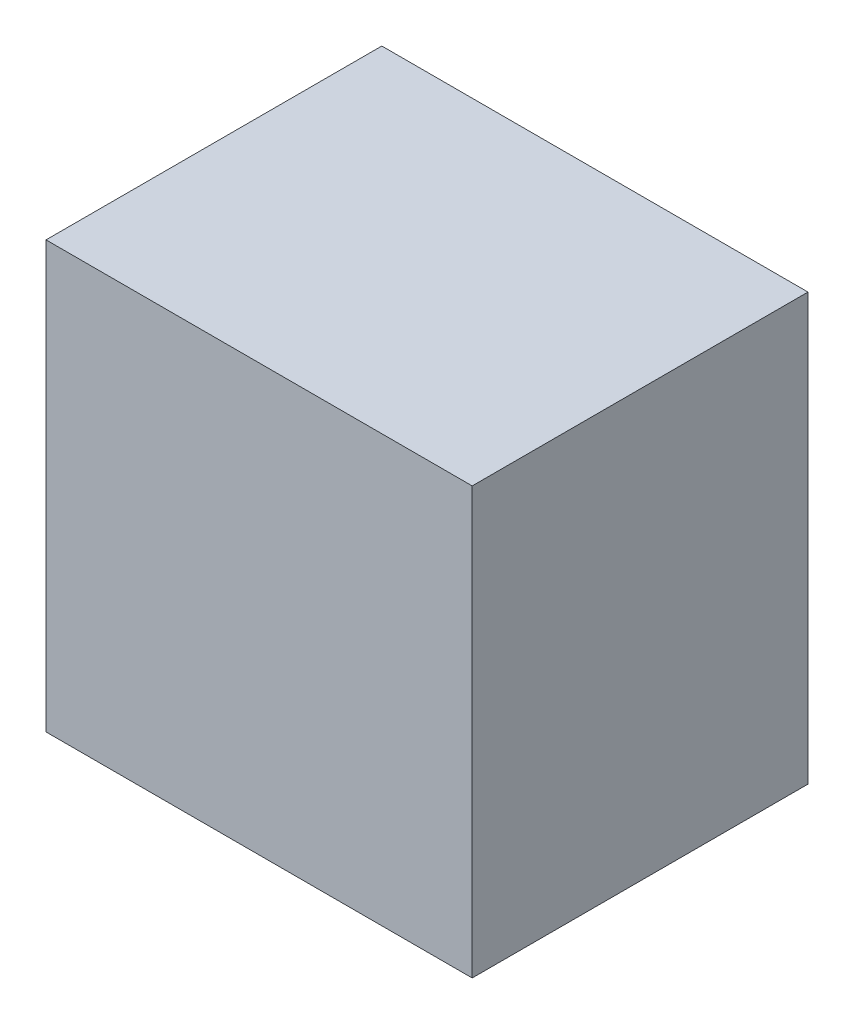
ISO-10303-21;
HEADER;
FILE_DESCRIPTION(('STEP AP214'),'2;1');
FILE_NAME('part.step','',(''),(''),'','','');
FILE_SCHEMA(('AUTOMOTIVE_DESIGN { 1 0 10303 214 1 1 1 1 }'));
ENDSEC;
DATA;
#1=APPLICATION_CONTEXT('core data for automotive mechanical design processes');
#2=APPLICATION_PROTOCOL_DEFINITION('international standard','automotive_design',2000,#1);
#3=PRODUCT_CONTEXT('',#1,'mechanical');
#4=PRODUCT('Part','Part','',(#3));
#5=PRODUCT_RELATED_PRODUCT_CATEGORY('part','',(#4));
#6=PRODUCT_DEFINITION_FORMATION('','',#4);
#7=PRODUCT_DEFINITION_CONTEXT('part definition',#1,'design');
#8=PRODUCT_DEFINITION('design','',#6,#7);
#9=PRODUCT_DEFINITION_SHAPE('','',#8);
#10=(LENGTH_UNIT() NAMED_UNIT(*) SI_UNIT(.MILLI.,.METRE.));
#11=(NAMED_UNIT(*) PLANE_ANGLE_UNIT() SI_UNIT($,.RADIAN.));
#12=(NAMED_UNIT(*) SI_UNIT($,.STERADIAN.) SOLID_ANGLE_UNIT());
#13=UNCERTAINTY_MEASURE_WITH_UNIT(LENGTH_MEASURE(1.E-05),#10,'distance_accuracy_value','');
#14=(GEOMETRIC_REPRESENTATION_CONTEXT(3) GLOBAL_UNCERTAINTY_ASSIGNED_CONTEXT((#13)) GLOBAL_UNIT_ASSIGNED_CONTEXT((#10,
#11,#12)) REPRESENTATION_CONTEXT('',''));
#15=CARTESIAN_POINT('',(0.,0.,0.));
#16=DIRECTION('',(0.,0.,1.));
#17=DIRECTION('',(1.,0.,0.));
#18=AXIS2_PLACEMENT_3D('',#15,#16,#17);
#19=CARTESIAN_POINT('',(0.1649984,0.1649984,0.));
#20=DIRECTION('',(0.,-1.,0.));
#21=DIRECTION('',(-1.,0.,0.));
#22=AXIS2_PLACEMENT_3D('',#19,#20,#21);
#23=PLANE('',#22);
#24=DIRECTION('',(-1.,0.,0.));
#25=VECTOR('',#24,1.);
#26=CARTESIAN_POINT('',(0.1649984,0.1649984,0.));
#27=LINE('',#26,#25);
#28=CARTESIAN_POINT('',(0.1649984,0.1649984,0.));
#29=VERTEX_POINT('',#28);
#30=CARTESIAN_POINT('',(-0.16499586,0.1649984,0.));
#31=VERTEX_POINT('',#30);
#32=EDGE_CURVE('E11',#29,#31,#27,.T.);
#33=ORIENTED_EDGE('',*,*,#32,.T.);
#34=DIRECTION('',(0.,0.,1.));
#35=VECTOR('',#34,1.);
#36=CARTESIAN_POINT('',(-0.16499586,0.1649984,0.));
#37=LINE('',#36,#35);
#38=CARTESIAN_POINT('',(-0.16499586,0.1649984,0.25999948));
#39=VERTEX_POINT('',#38);
#40=EDGE_CURVE('E24',#31,#39,#37,.T.);
#41=ORIENTED_EDGE('',*,*,#40,.T.);
#42=DIRECTION('',(-1.,0.,0.));
#43=VECTOR('',#42,1.);
#44=CARTESIAN_POINT('',(0.1649984,0.1649984,0.25999948));
#45=LINE('',#44,#43);
#46=CARTESIAN_POINT('',(0.1649984,0.1649984,0.25999948));
#47=VERTEX_POINT('',#46);
#48=EDGE_CURVE('E87',#47,#39,#45,.T.);
#49=ORIENTED_EDGE('',*,*,#48,.F.);
#50=DIRECTION('',(0.,0.,1.));
#51=VECTOR('',#50,1.);
#52=CARTESIAN_POINT('',(0.1649984,0.1649984,0.));
#53=LINE('',#52,#51);
#54=EDGE_CURVE('E36',#29,#47,#53,.T.);
#55=ORIENTED_EDGE('',*,*,#54,.F.);
#56=EDGE_LOOP('',(#33,#41,#49,#55));
#57=FACE_BOUND('',#56,.T.);
#58=ADVANCED_FACE('F17',(#57),#23,.F.);
#59=CARTESIAN_POINT('',(-0.16499586,0.1649984,0.));
#60=DIRECTION('',(0.999999999970377,-7.69710361366391E-06,0.));
#61=DIRECTION('',(-7.69710361366391E-06,-0.999999999970377,0.));
#62=AXIS2_PLACEMENT_3D('',#59,#60,#61);
#63=PLANE('',#62);
#64=DIRECTION('',(-7.69710361366391E-06,-0.999999999970377,0.));
#65=VECTOR('',#64,1.);
#66=CARTESIAN_POINT('',(-0.16499586,0.1649984,0.));
#67=LINE('',#66,#65);
#68=CARTESIAN_POINT('',(-0.1649984,-0.16499586,0.));
#69=VERTEX_POINT('',#68);
#70=EDGE_CURVE('E84',#31,#69,#67,.T.);
#71=ORIENTED_EDGE('',*,*,#70,.T.);
#72=DIRECTION('',(0.,0.,1.));
#73=VECTOR('',#72,1.);
#74=CARTESIAN_POINT('',(-0.1649984,-0.16499586,0.));
#75=LINE('',#74,#73);
#76=CARTESIAN_POINT('',(-0.1649984,-0.16499586,0.25999948));
#77=VERTEX_POINT('',#76);
#78=EDGE_CURVE('E82',#69,#77,#75,.T.);
#79=ORIENTED_EDGE('',*,*,#78,.T.);
#80=DIRECTION('',(-7.69710361366391E-06,-0.999999999970377,0.));
#81=VECTOR('',#80,1.);
#82=CARTESIAN_POINT('',(-0.16499586,0.1649984,0.25999948));
#83=LINE('',#82,#81);
#84=EDGE_CURVE('E62',#39,#77,#83,.T.);
#85=ORIENTED_EDGE('',*,*,#84,.F.);
#86=ORIENTED_EDGE('',*,*,#40,.F.);
#87=EDGE_LOOP('',(#71,#79,#85,#86));
#88=FACE_BOUND('',#87,.T.);
#89=ADVANCED_FACE('F89',(#88),#63,.F.);
#90=CARTESIAN_POINT('',(-0.1649984,-0.16499586,0.));
#91=DIRECTION('',(0.,1.,0.));
#92=DIRECTION('',(1.,0.,0.));
#93=AXIS2_PLACEMENT_3D('',#90,#91,#92);
#94=PLANE('',#93);
#95=DIRECTION('',(1.,0.,0.));
#96=VECTOR('',#95,1.);
#97=CARTESIAN_POINT('',(-0.1649984,-0.16499586,0.));
#98=LINE('',#97,#96);
#99=CARTESIAN_POINT('',(0.1649984,-0.16499586,0.));
#100=VERTEX_POINT('',#99);
#101=EDGE_CURVE('E71',#69,#100,#98,.T.);
#102=ORIENTED_EDGE('',*,*,#101,.T.);
#103=DIRECTION('',(0.,0.,1.));
#104=VECTOR('',#103,1.);
#105=CARTESIAN_POINT('',(0.1649984,-0.16499586,0.));
#106=LINE('',#105,#104);
#107=CARTESIAN_POINT('',(0.1649984,-0.16499586,0.25999948));
#108=VERTEX_POINT('',#107);
#109=EDGE_CURVE('E65',#100,#108,#106,.T.);
#110=ORIENTED_EDGE('',*,*,#109,.T.);
#111=DIRECTION('',(1.,0.,0.));
#112=VECTOR('',#111,1.);
#113=CARTESIAN_POINT('',(-0.1649984,-0.16499586,0.25999948));
#114=LINE('',#113,#112);
#115=EDGE_CURVE('E57',#77,#108,#114,.T.);
#116=ORIENTED_EDGE('',*,*,#115,.F.);
#117=ORIENTED_EDGE('',*,*,#78,.F.);
#118=EDGE_LOOP('',(#102,#110,#116,#117));
#119=FACE_BOUND('',#118,.T.);
#120=ADVANCED_FACE('F69',(#119),#94,.F.);
#121=CARTESIAN_POINT('',(0.1649984,-0.16499586,0.));
#122=DIRECTION('',(-1.,0.,0.));
#123=DIRECTION('',(0.,1.,0.));
#124=AXIS2_PLACEMENT_3D('',#121,#122,#123);
#125=PLANE('',#124);
#126=DIRECTION('',(0.,1.,0.));
#127=VECTOR('',#126,1.);
#128=CARTESIAN_POINT('',(0.1649984,-0.16499586,0.));
#129=LINE('',#128,#127);
#130=EDGE_CURVE('E66',#100,#29,#129,.T.);
#131=ORIENTED_EDGE('',*,*,#130,.T.);
#132=ORIENTED_EDGE('',*,*,#54,.T.);
#133=DIRECTION('',(0.,1.,0.));
#134=VECTOR('',#133,1.);
#135=CARTESIAN_POINT('',(0.1649984,-0.16499586,0.25999948));
#136=LINE('',#135,#134);
#137=EDGE_CURVE('E61',#108,#47,#136,.T.);
#138=ORIENTED_EDGE('',*,*,#137,.F.);
#139=ORIENTED_EDGE('',*,*,#109,.F.);
#140=EDGE_LOOP('',(#131,#132,#138,#139));
#141=FACE_BOUND('',#140,.T.);
#142=ADVANCED_FACE('F76',(#141),#125,.F.);
#143=CARTESIAN_POINT('',(6.349975660892E-07,9.52500608051E-07,0.));
#144=DIRECTION('',(0.,0.,1.));
#145=DIRECTION('',(1.,0.,0.));
#146=AXIS2_PLACEMENT_3D('',#143,#144,#145);
#147=PLANE('',#146);
#148=ORIENTED_EDGE('',*,*,#130,.F.);
#149=ORIENTED_EDGE('',*,*,#101,.F.);
#150=ORIENTED_EDGE('',*,*,#70,.F.);
#151=ORIENTED_EDGE('',*,*,#32,.F.);
#152=EDGE_LOOP('',(#148,#149,#150,#151));
#153=FACE_BOUND('',#152,.T.);
#154=ADVANCED_FACE('F91',(#153),#147,.F.);
#155=CARTESIAN_POINT('',(6.349975660892E-07,9.52500608051E-07,0.25999948));
#156=DIRECTION('',(0.,0.,1.));
#157=DIRECTION('',(1.,0.,0.));
#158=AXIS2_PLACEMENT_3D('',#155,#156,#157);
#159=PLANE('',#158);
#160=ORIENTED_EDGE('',*,*,#48,.T.);
#161=ORIENTED_EDGE('',*,*,#84,.T.);
#162=ORIENTED_EDGE('',*,*,#115,.T.);
#163=ORIENTED_EDGE('',*,*,#137,.T.);
#164=EDGE_LOOP('',(#160,#161,#162,#163));
#165=FACE_BOUND('',#164,.T.);
#166=ADVANCED_FACE('F59',(#165),#159,.T.);
#167=CLOSED_SHELL('',(#58,#89,#120,#142,#154,#166));
#168=MANIFOLD_SOLID_BREP('B1',#167);
#169=ADVANCED_BREP_SHAPE_REPRESENTATION('',(#18,#168),#14);
#170=SHAPE_DEFINITION_REPRESENTATION(#9,#169);
ENDSEC;
END-ISO-10303-21;
